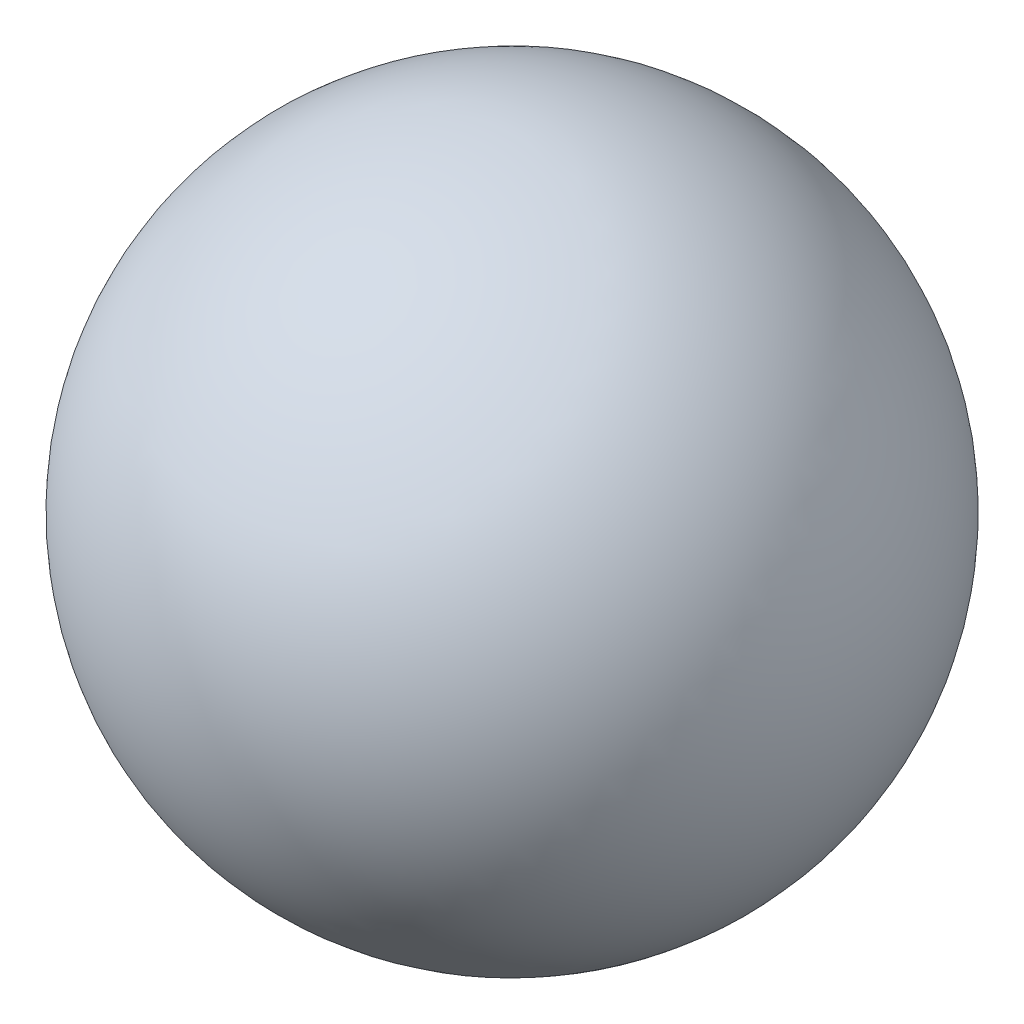
ISO-10303-21;
HEADER;
FILE_DESCRIPTION(('STEP AP214'),'2;1');
FILE_NAME('part.step','',(''),(''),'','','');
FILE_SCHEMA(('AUTOMOTIVE_DESIGN { 1 0 10303 214 1 1 1 1 }'));
ENDSEC;
DATA;
#1=APPLICATION_CONTEXT('core data for automotive mechanical design processes');
#2=APPLICATION_PROTOCOL_DEFINITION('international standard','automotive_design',2000,#1);
#3=PRODUCT_CONTEXT('',#1,'mechanical');
#4=PRODUCT('Part','Part','',(#3));
#5=PRODUCT_RELATED_PRODUCT_CATEGORY('part','',(#4));
#6=PRODUCT_DEFINITION_FORMATION('','',#4);
#7=PRODUCT_DEFINITION_CONTEXT('part definition',#1,'design');
#8=PRODUCT_DEFINITION('design','',#6,#7);
#9=PRODUCT_DEFINITION_SHAPE('','',#8);
#10=(LENGTH_UNIT() NAMED_UNIT(*) SI_UNIT(.MILLI.,.METRE.));
#11=(NAMED_UNIT(*) PLANE_ANGLE_UNIT() SI_UNIT($,.RADIAN.));
#12=(NAMED_UNIT(*) SI_UNIT($,.STERADIAN.) SOLID_ANGLE_UNIT());
#13=UNCERTAINTY_MEASURE_WITH_UNIT(LENGTH_MEASURE(1.E-05),#10,'distance_accuracy_value','');
#14=(GEOMETRIC_REPRESENTATION_CONTEXT(3) GLOBAL_UNCERTAINTY_ASSIGNED_CONTEXT((#13)) GLOBAL_UNIT_ASSIGNED_CONTEXT((#10,
#11,#12)) REPRESENTATION_CONTEXT('',''));
#15=CARTESIAN_POINT('',(0.,0.,0.));
#16=DIRECTION('',(0.,0.,1.));
#17=DIRECTION('',(1.,0.,0.));
#18=AXIS2_PLACEMENT_3D('',#15,#16,#17);
#19=CARTESIAN_POINT('',(49.75,-51.7948924394539,-11.2354847441219));
#20=DIRECTION('',(0.,-0.977271341040084,-0.211992278118131));
#21=DIRECTION('',(0.173648177666934,0.208771639069456,-0.962424393452912));
#22=AXIS2_PLACEMENT_3D('',#19,#20,#21);
#23=SPHERICAL_SURFACE('',#22,5.95);
#24=CARTESIAN_POINT('',(49.75,-57.6096569186424,-12.4968387989248));
#25=VERTEX_POINT('',#24);
#26=VERTEX_LOOP('',#25);
#27=FACE_BOUND('',#26,.T.);
#28=CARTESIAN_POINT('',(49.75,-45.9801279602654,-9.97413068931902));
#29=VERTEX_POINT('',#28);
#30=VERTEX_LOOP('',#29);
#31=FACE_BOUND('',#30,.T.);
#32=ADVANCED_FACE('F16',(#27,#31),#23,.T.);
#33=CLOSED_SHELL('',(#32));
#34=MANIFOLD_SOLID_BREP('B1',#33);
#35=ADVANCED_BREP_SHAPE_REPRESENTATION('',(#18,#34),#14);
#36=SHAPE_DEFINITION_REPRESENTATION(#9,#35);
ENDSEC;
END-ISO-10303-21;
